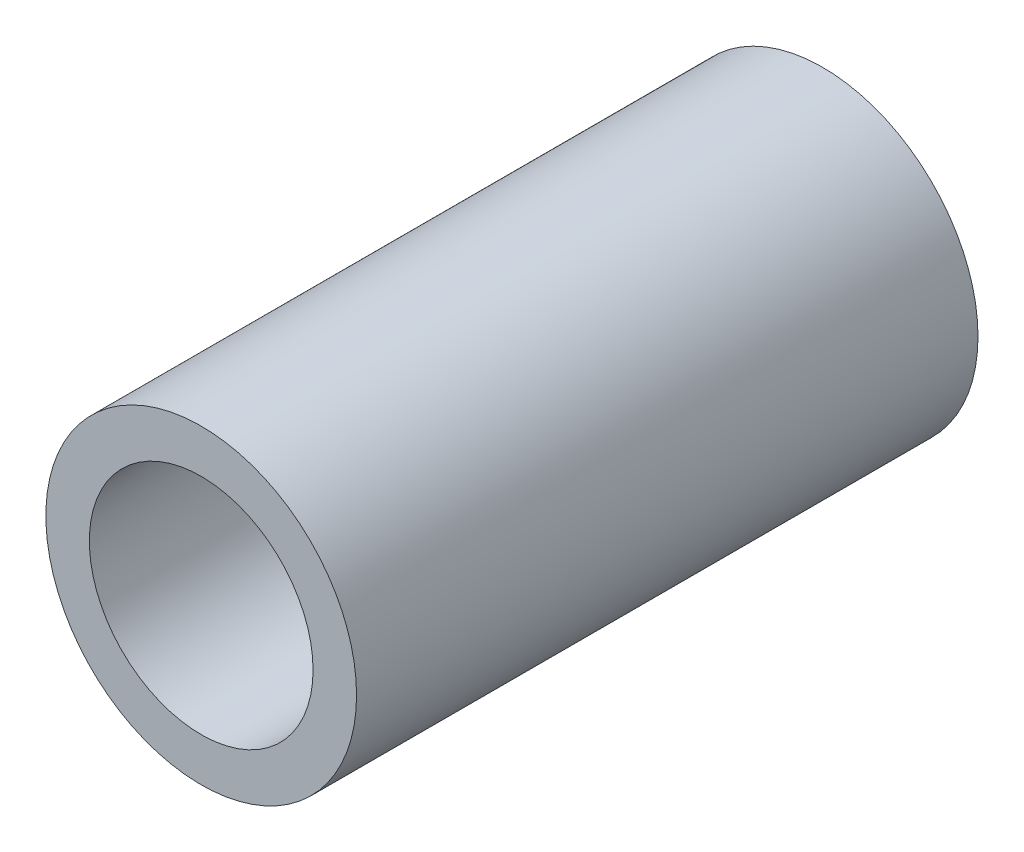
ISO-10303-21;
HEADER;
FILE_DESCRIPTION(('STEP AP214'),'2;1');
FILE_NAME('part.step','',(''),(''),'','','');
FILE_SCHEMA(('AUTOMOTIVE_DESIGN { 1 0 10303 214 1 1 1 1 }'));
ENDSEC;
DATA;
#1=APPLICATION_CONTEXT('core data for automotive mechanical design processes');
#2=APPLICATION_PROTOCOL_DEFINITION('international standard','automotive_design',2000,#1);
#3=PRODUCT_CONTEXT('',#1,'mechanical');
#4=PRODUCT('Part','Part','',(#3));
#5=PRODUCT_RELATED_PRODUCT_CATEGORY('part','',(#4));
#6=PRODUCT_DEFINITION_FORMATION('','',#4);
#7=PRODUCT_DEFINITION_CONTEXT('part definition',#1,'design');
#8=PRODUCT_DEFINITION('design','',#6,#7);
#9=PRODUCT_DEFINITION_SHAPE('','',#8);
#10=(LENGTH_UNIT() NAMED_UNIT(*) SI_UNIT(.MILLI.,.METRE.));
#11=(NAMED_UNIT(*) PLANE_ANGLE_UNIT() SI_UNIT($,.RADIAN.));
#12=(NAMED_UNIT(*) SI_UNIT($,.STERADIAN.) SOLID_ANGLE_UNIT());
#13=UNCERTAINTY_MEASURE_WITH_UNIT(LENGTH_MEASURE(1.E-05),#10,'distance_accuracy_value','');
#14=(GEOMETRIC_REPRESENTATION_CONTEXT(3) GLOBAL_UNCERTAINTY_ASSIGNED_CONTEXT((#13)) GLOBAL_UNIT_ASSIGNED_CONTEXT((#10,
#11,#12)) REPRESENTATION_CONTEXT('',''));
#15=CARTESIAN_POINT('',(0.,0.,0.));
#16=DIRECTION('',(0.,0.,1.));
#17=DIRECTION('',(1.,0.,0.));
#18=AXIS2_PLACEMENT_3D('',#15,#16,#17);
#19=CARTESIAN_POINT('',(0.,0.,3.175));
#20=DIRECTION('',(0.,0.,1.));
#21=DIRECTION('',(1.,0.,0.));
#22=AXIS2_PLACEMENT_3D('',#19,#20,#21);
#23=PLANE('',#22);
#24=CARTESIAN_POINT('',(0.,0.,3.175));
#25=DIRECTION('',(0.,0.,1.));
#26=DIRECTION('',(1.,0.,0.));
#27=AXIS2_PLACEMENT_3D('',#24,#25,#26);
#28=CIRCLE('',#27,1.5875);
#29=CARTESIAN_POINT('',(1.5875,0.,3.175));
#30=VERTEX_POINT('',#29);
#31=EDGE_CURVE('E10',#30,#30,#28,.T.);
#32=ORIENTED_EDGE('',*,*,#31,.T.);
#33=EDGE_LOOP('',(#32));
#34=FACE_BOUND('',#33,.T.);
#35=CARTESIAN_POINT('',(0.,0.,3.175));
#36=DIRECTION('',(0.,0.,1.));
#37=DIRECTION('',(1.,0.,0.));
#38=AXIS2_PLACEMENT_3D('',#35,#36,#37);
#39=CIRCLE('',#38,1.143);
#40=CARTESIAN_POINT('',(1.143,0.,3.175));
#41=VERTEX_POINT('',#40);
#42=EDGE_CURVE('E41',#41,#41,#39,.T.);
#43=ORIENTED_EDGE('',*,*,#42,.F.);
#44=EDGE_LOOP('',(#43));
#45=FACE_BOUND('',#44,.T.);
#46=ADVANCED_FACE('F34',(#34,#45),#23,.T.);
#47=CARTESIAN_POINT('',(0.,0.,3.175));
#48=DIRECTION('',(0.,0.,-1.));
#49=DIRECTION('',(-1.,0.,0.));
#50=AXIS2_PLACEMENT_3D('',#47,#48,#49);
#51=CYLINDRICAL_SURFACE('',#50,1.5875);
#52=ORIENTED_EDGE('',*,*,#31,.F.);
#53=EDGE_LOOP('',(#52));
#54=FACE_BOUND('',#53,.T.);
#55=CARTESIAN_POINT('',(0.,0.,-3.175));
#56=DIRECTION('',(0.,0.,1.));
#57=DIRECTION('',(1.,0.,0.));
#58=AXIS2_PLACEMENT_3D('',#55,#56,#57);
#59=CIRCLE('',#58,1.5875);
#60=CARTESIAN_POINT('',(1.5875,0.,-3.175));
#61=VERTEX_POINT('',#60);
#62=EDGE_CURVE('E45',#61,#61,#59,.T.);
#63=ORIENTED_EDGE('',*,*,#62,.T.);
#64=EDGE_LOOP('',(#63));
#65=FACE_BOUND('',#64,.T.);
#66=ADVANCED_FACE('F36',(#54,#65),#51,.T.);
#67=CARTESIAN_POINT('',(0.,0.,3.175));
#68=DIRECTION('',(0.,0.,-1.));
#69=DIRECTION('',(-1.,0.,0.));
#70=AXIS2_PLACEMENT_3D('',#67,#68,#69);
#71=CYLINDRICAL_SURFACE('',#70,1.143);
#72=ORIENTED_EDGE('',*,*,#42,.T.);
#73=EDGE_LOOP('',(#72));
#74=FACE_BOUND('',#73,.T.);
#75=CARTESIAN_POINT('',(0.,0.,-3.175));
#76=DIRECTION('',(0.,0.,1.));
#77=DIRECTION('',(1.,0.,0.));
#78=AXIS2_PLACEMENT_3D('',#75,#76,#77);
#79=CIRCLE('',#78,1.143);
#80=CARTESIAN_POINT('',(1.143,0.,-3.175));
#81=VERTEX_POINT('',#80);
#82=EDGE_CURVE('E49',#81,#81,#79,.T.);
#83=ORIENTED_EDGE('',*,*,#82,.F.);
#84=EDGE_LOOP('',(#83));
#85=FACE_BOUND('',#84,.T.);
#86=ADVANCED_FACE('F58',(#74,#85),#71,.F.);
#87=CARTESIAN_POINT('',(0.,0.,-3.175));
#88=DIRECTION('',(0.,0.,1.));
#89=DIRECTION('',(1.,0.,0.));
#90=AXIS2_PLACEMENT_3D('',#87,#88,#89);
#91=PLANE('',#90);
#92=ORIENTED_EDGE('',*,*,#82,.T.);
#93=EDGE_LOOP('',(#92));
#94=FACE_BOUND('',#93,.T.);
#95=ORIENTED_EDGE('',*,*,#62,.F.);
#96=EDGE_LOOP('',(#95));
#97=FACE_BOUND('',#96,.T.);
#98=ADVANCED_FACE('F55',(#94,#97),#91,.F.);
#99=CLOSED_SHELL('',(#46,#66,#86,#98));
#100=MANIFOLD_SOLID_BREP('B2',#99);
#101=ADVANCED_BREP_SHAPE_REPRESENTATION('',(#18,#100),#14);
#102=SHAPE_DEFINITION_REPRESENTATION(#9,#101);
ENDSEC;
END-ISO-10303-21;
